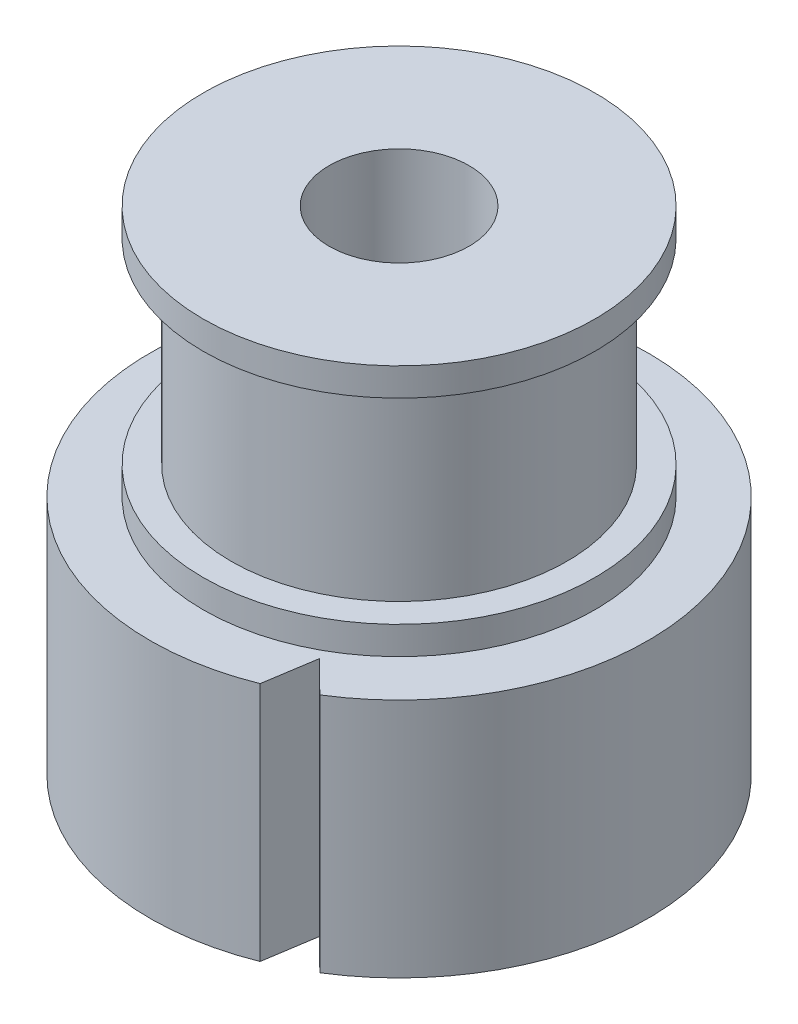
ISO-10303-21;
HEADER;
FILE_DESCRIPTION(('STEP AP214'),'2;1');
FILE_NAME('part.step','',(''),(''),'','','');
FILE_SCHEMA(('AUTOMOTIVE_DESIGN { 1 0 10303 214 1 1 1 1 }'));
ENDSEC;
DATA;
#1=APPLICATION_CONTEXT('core data for automotive mechanical design processes');
#2=APPLICATION_PROTOCOL_DEFINITION('international standard','automotive_design',2000,#1);
#3=PRODUCT_CONTEXT('',#1,'mechanical');
#4=PRODUCT('Part','Part','',(#3));
#5=PRODUCT_RELATED_PRODUCT_CATEGORY('part','',(#4));
#6=PRODUCT_DEFINITION_FORMATION('','',#4);
#7=PRODUCT_DEFINITION_CONTEXT('part definition',#1,'design');
#8=PRODUCT_DEFINITION('design','',#6,#7);
#9=PRODUCT_DEFINITION_SHAPE('','',#8);
#10=(LENGTH_UNIT() NAMED_UNIT(*) SI_UNIT(.MILLI.,.METRE.));
#11=(NAMED_UNIT(*) PLANE_ANGLE_UNIT() SI_UNIT($,.RADIAN.));
#12=(NAMED_UNIT(*) SI_UNIT($,.STERADIAN.) SOLID_ANGLE_UNIT());
#13=UNCERTAINTY_MEASURE_WITH_UNIT(LENGTH_MEASURE(1.E-05),#10,'distance_accuracy_value','');
#14=(GEOMETRIC_REPRESENTATION_CONTEXT(3) GLOBAL_UNCERTAINTY_ASSIGNED_CONTEXT((#13)) GLOBAL_UNIT_ASSIGNED_CONTEXT((#10,
#11,#12)) REPRESENTATION_CONTEXT('',''));
#15=CARTESIAN_POINT('',(0.,0.,0.));
#16=DIRECTION('',(0.,0.,1.));
#17=DIRECTION('',(1.,0.,0.));
#18=AXIS2_PLACEMENT_3D('',#15,#16,#17);
#19=CARTESIAN_POINT('',(0.,9.6,0.));
#20=DIRECTION('',(0.,1.,0.));
#21=DIRECTION('',(0.,0.,1.));
#22=AXIS2_PLACEMENT_3D('',#19,#20,#21);
#23=PLANE('',#22);
#24=CARTESIAN_POINT('',(0.,9.6,0.));
#25=DIRECTION('',(0.,1.,0.));
#26=DIRECTION('',(0.,0.,1.));
#27=AXIS2_PLACEMENT_3D('',#24,#25,#26);
#28=CIRCLE('',#27,7.);
#29=CARTESIAN_POINT('',(0.,9.6,7.));
#30=VERTEX_POINT('',#29);
#31=EDGE_CURVE('E105',#30,#30,#28,.T.);
#32=ORIENTED_EDGE('',*,*,#31,.T.);
#33=EDGE_LOOP('',(#32));
#34=FACE_BOUND('',#33,.T.);
#35=CARTESIAN_POINT('',(0.,9.6,0.));
#36=DIRECTION('',(0.,1.,0.));
#37=DIRECTION('',(0.,0.,1.));
#38=AXIS2_PLACEMENT_3D('',#35,#36,#37);
#39=CIRCLE('',#38,6.);
#40=CARTESIAN_POINT('',(0.,9.6,6.));
#41=VERTEX_POINT('',#40);
#42=EDGE_CURVE('E96',#41,#41,#39,.T.);
#43=ORIENTED_EDGE('',*,*,#42,.F.);
#44=EDGE_LOOP('',(#43));
#45=FACE_BOUND('',#44,.T.);
#46=ADVANCED_FACE('F32',(#34,#45),#23,.T.);
#47=CARTESIAN_POINT('',(0.,8.6,0.));
#48=DIRECTION('',(0.,1.,0.));
#49=DIRECTION('',(0.,0.,1.));
#50=AXIS2_PLACEMENT_3D('',#47,#48,#49);
#51=PLANE('',#50);
#52=DIRECTION('',(-0.154111230443251,0.,0.988053504953688));
#53=VECTOR('',#52,1.);
#54=CARTESIAN_POINT('',(3.29961233485813,8.6,8.26574609092561));
#55=LINE('',#54,#53);
#56=CARTESIAN_POINT('',(3.58541301827131,8.6,6.43339184813385));
#57=VERTEX_POINT('',#56);
#58=CARTESIAN_POINT('',(3.29961233485813,8.6,8.26574609092561));
#59=VERTEX_POINT('',#58);
#60=EDGE_CURVE('E66',#57,#59,#55,.T.);
#61=ORIENTED_EDGE('',*,*,#60,.F.);
#62=DIRECTION('',(-0.7119251319797,0.,-0.702255371254423));
#63=VECTOR('',#62,1.);
#64=CARTESIAN_POINT('',(3.58541301827131,8.6,6.43339184813385));
#65=LINE('',#64,#63);
#66=CARTESIAN_POINT('',(4.71549189458936,8.6,7.54812136839771));
#67=VERTEX_POINT('',#66);
#68=EDGE_CURVE('E72',#67,#57,#65,.T.);
#69=ORIENTED_EDGE('',*,*,#68,.F.);
#70=CARTESIAN_POINT('',(0.,8.6,0.));
#71=DIRECTION('',(0.,1.,0.));
#72=DIRECTION('',(0.,0.,1.));
#73=AXIS2_PLACEMENT_3D('',#70,#71,#72);
#74=CIRCLE('',#73,8.9);
#75=EDGE_CURVE('E11',#67,#59,#74,.T.);
#76=ORIENTED_EDGE('',*,*,#75,.T.);
#77=EDGE_LOOP('',(#61,#69,#76));
#78=FACE_BOUND('',#77,.T.);
#79=CARTESIAN_POINT('',(0.,8.6,0.));
#80=DIRECTION('',(0.,1.,0.));
#81=DIRECTION('',(0.,0.,1.));
#82=AXIS2_PLACEMENT_3D('',#79,#80,#81);
#83=CIRCLE('',#82,7.);
#84=CARTESIAN_POINT('',(0.,8.6,7.));
#85=VERTEX_POINT('',#84);
#86=EDGE_CURVE('E102',#85,#85,#83,.T.);
#87=ORIENTED_EDGE('',*,*,#86,.F.);
#88=EDGE_LOOP('',(#87));
#89=FACE_BOUND('',#88,.T.);
#90=ADVANCED_FACE('F80',(#78,#89),#51,.T.);
#91=CARTESIAN_POINT('',(0.,0.,0.));
#92=DIRECTION('',(0.,1.,0.));
#93=DIRECTION('',(0.,0.,1.));
#94=AXIS2_PLACEMENT_3D('',#91,#92,#93);
#95=PLANE('',#94);
#96=DIRECTION('',(-0.7119251319797,0.,-0.702255371254423));
#97=VECTOR('',#96,1.);
#98=CARTESIAN_POINT('',(3.58541301827131,0.,6.43339184813385));
#99=LINE('',#98,#97);
#100=CARTESIAN_POINT('',(4.71549189458936,0.,7.54812136839771));
#101=VERTEX_POINT('',#100);
#102=CARTESIAN_POINT('',(3.58541301827131,0.,6.43339184813385));
#103=VERTEX_POINT('',#102);
#104=EDGE_CURVE('E47',#101,#103,#99,.T.);
#105=ORIENTED_EDGE('',*,*,#104,.T.);
#106=DIRECTION('',(-0.154111230443251,0.,0.988053504953688));
#107=VECTOR('',#106,1.);
#108=CARTESIAN_POINT('',(3.29961233485813,0.,8.26574609092561));
#109=LINE('',#108,#107);
#110=CARTESIAN_POINT('',(3.29961233485813,0.,8.26574609092561));
#111=VERTEX_POINT('',#110);
#112=EDGE_CURVE('E84',#103,#111,#109,.T.);
#113=ORIENTED_EDGE('',*,*,#112,.T.);
#114=CARTESIAN_POINT('',(0.,0.,0.));
#115=DIRECTION('',(0.,1.,0.));
#116=DIRECTION('',(0.,0.,1.));
#117=AXIS2_PLACEMENT_3D('',#114,#115,#116);
#118=CIRCLE('',#117,8.9);
#119=EDGE_CURVE('E36',#101,#111,#118,.T.);
#120=ORIENTED_EDGE('',*,*,#119,.F.);
#121=EDGE_LOOP('',(#105,#113,#120));
#122=FACE_BOUND('',#121,.T.);
#123=CARTESIAN_POINT('',(0.,0.,0.));
#124=DIRECTION('',(0.,1.,0.));
#125=DIRECTION('',(0.,0.,1.));
#126=AXIS2_PLACEMENT_3D('',#123,#124,#125);
#127=CIRCLE('',#126,2.5);
#128=CARTESIAN_POINT('',(0.,0.,2.5));
#129=VERTEX_POINT('',#128);
#130=EDGE_CURVE('E108',#129,#129,#127,.T.);
#131=ORIENTED_EDGE('',*,*,#130,.T.);
#132=EDGE_LOOP('',(#131));
#133=FACE_BOUND('',#132,.T.);
#134=ADVANCED_FACE('F114',(#122,#133),#95,.F.);
#135=CARTESIAN_POINT('',(0.,8.6,0.));
#136=DIRECTION('',(0.,-1.,0.));
#137=DIRECTION('',(0.,0.,-1.));
#138=AXIS2_PLACEMENT_3D('',#135,#136,#137);
#139=CYLINDRICAL_SURFACE('',#138,8.9);
#140=ORIENTED_EDGE('',*,*,#119,.T.);
#141=DIRECTION('',(0.,1.,0.));
#142=VECTOR('',#141,1.);
#143=CARTESIAN_POINT('',(3.29961233485813,0.,8.26574609092561));
#144=LINE('',#143,#142);
#145=EDGE_CURVE('E56',#111,#59,#144,.T.);
#146=ORIENTED_EDGE('',*,*,#145,.T.);
#147=ORIENTED_EDGE('',*,*,#75,.F.);
#148=DIRECTION('',(0.,1.,0.));
#149=VECTOR('',#148,1.);
#150=CARTESIAN_POINT('',(4.71549189458936,0.,7.54812136839771));
#151=LINE('',#150,#149);
#152=EDGE_CURVE('E88',#101,#67,#151,.T.);
#153=ORIENTED_EDGE('',*,*,#152,.F.);
#154=EDGE_LOOP('',(#140,#146,#147,#153));
#155=FACE_BOUND('',#154,.T.);
#156=ADVANCED_FACE('F34',(#155),#139,.T.);
#157=CARTESIAN_POINT('',(0.,8.6,0.));
#158=DIRECTION('',(0.,-1.,0.));
#159=DIRECTION('',(0.,0.,-1.));
#160=AXIS2_PLACEMENT_3D('',#157,#158,#159);
#161=CYLINDRICAL_SURFACE('',#160,2.5);
#162=ORIENTED_EDGE('',*,*,#130,.F.);
#163=EDGE_LOOP('',(#162));
#164=FACE_BOUND('',#163,.T.);
#165=CARTESIAN_POINT('',(0.,17.6,0.));
#166=DIRECTION('',(0.,1.,0.));
#167=DIRECTION('',(0.,0.,1.));
#168=AXIS2_PLACEMENT_3D('',#165,#166,#167);
#169=CIRCLE('',#168,2.5);
#170=CARTESIAN_POINT('',(0.,17.6,2.5));
#171=VERTEX_POINT('',#170);
#172=EDGE_CURVE('E78',#171,#171,#169,.T.);
#173=ORIENTED_EDGE('',*,*,#172,.T.);
#174=EDGE_LOOP('',(#173));
#175=FACE_BOUND('',#174,.T.);
#176=ADVANCED_FACE('F116',(#164,#175),#161,.F.);
#177=CARTESIAN_POINT('',(0.,9.6,0.));
#178=DIRECTION('',(0.,-1.,0.));
#179=DIRECTION('',(0.,0.,-1.));
#180=AXIS2_PLACEMENT_3D('',#177,#178,#179);
#181=CYLINDRICAL_SURFACE('',#180,7.);
#182=ORIENTED_EDGE('',*,*,#31,.F.);
#183=EDGE_LOOP('',(#182));
#184=FACE_BOUND('',#183,.T.);
#185=ORIENTED_EDGE('',*,*,#86,.T.);
#186=EDGE_LOOP('',(#185));
#187=FACE_BOUND('',#186,.T.);
#188=ADVANCED_FACE('F119',(#184,#187),#181,.T.);
#189=CARTESIAN_POINT('',(0.,16.6,0.));
#190=DIRECTION('',(0.,-1.,0.));
#191=DIRECTION('',(0.,0.,-1.));
#192=AXIS2_PLACEMENT_3D('',#189,#190,#191);
#193=CYLINDRICAL_SURFACE('',#192,6.);
#194=CARTESIAN_POINT('',(0.,16.6,0.));
#195=DIRECTION('',(0.,1.,0.));
#196=DIRECTION('',(0.,0.,1.));
#197=AXIS2_PLACEMENT_3D('',#194,#195,#196);
#198=CIRCLE('',#197,6.);
#199=CARTESIAN_POINT('',(0.,16.6,6.));
#200=VERTEX_POINT('',#199);
#201=EDGE_CURVE('E99',#200,#200,#198,.T.);
#202=ORIENTED_EDGE('',*,*,#201,.F.);
#203=EDGE_LOOP('',(#202));
#204=FACE_BOUND('',#203,.T.);
#205=ORIENTED_EDGE('',*,*,#42,.T.);
#206=EDGE_LOOP('',(#205));
#207=FACE_BOUND('',#206,.T.);
#208=ADVANCED_FACE('F126',(#204,#207),#193,.T.);
#209=CARTESIAN_POINT('',(0.,17.6,0.));
#210=DIRECTION('',(0.,1.,0.));
#211=DIRECTION('',(0.,0.,1.));
#212=AXIS2_PLACEMENT_3D('',#209,#210,#211);
#213=PLANE('',#212);
#214=CARTESIAN_POINT('',(0.,17.6,0.));
#215=DIRECTION('',(0.,1.,0.));
#216=DIRECTION('',(0.,0.,1.));
#217=AXIS2_PLACEMENT_3D('',#214,#215,#216);
#218=CIRCLE('',#217,7.);
#219=CARTESIAN_POINT('',(0.,17.6,7.));
#220=VERTEX_POINT('',#219);
#221=EDGE_CURVE('E93',#220,#220,#218,.T.);
#222=ORIENTED_EDGE('',*,*,#221,.T.);
#223=EDGE_LOOP('',(#222));
#224=FACE_BOUND('',#223,.T.);
#225=ORIENTED_EDGE('',*,*,#172,.F.);
#226=EDGE_LOOP('',(#225));
#227=FACE_BOUND('',#226,.T.);
#228=ADVANCED_FACE('F123',(#224,#227),#213,.T.);
#229=CARTESIAN_POINT('',(0.,16.6,0.));
#230=DIRECTION('',(0.,1.,0.));
#231=DIRECTION('',(0.,0.,1.));
#232=AXIS2_PLACEMENT_3D('',#229,#230,#231);
#233=PLANE('',#232);
#234=ORIENTED_EDGE('',*,*,#201,.T.);
#235=EDGE_LOOP('',(#234));
#236=FACE_BOUND('',#235,.T.);
#237=CARTESIAN_POINT('',(0.,16.6,0.));
#238=DIRECTION('',(0.,1.,0.));
#239=DIRECTION('',(0.,0.,1.));
#240=AXIS2_PLACEMENT_3D('',#237,#238,#239);
#241=CIRCLE('',#240,7.);
#242=CARTESIAN_POINT('',(0.,16.6,7.));
#243=VERTEX_POINT('',#242);
#244=EDGE_CURVE('E92',#243,#243,#241,.T.);
#245=ORIENTED_EDGE('',*,*,#244,.F.);
#246=EDGE_LOOP('',(#245));
#247=FACE_BOUND('',#246,.T.);
#248=ADVANCED_FACE('F125',(#236,#247),#233,.F.);
#249=CARTESIAN_POINT('',(0.,17.6,0.));
#250=DIRECTION('',(0.,-1.,0.));
#251=DIRECTION('',(0.,0.,-1.));
#252=AXIS2_PLACEMENT_3D('',#249,#250,#251);
#253=CYLINDRICAL_SURFACE('',#252,7.);
#254=ORIENTED_EDGE('',*,*,#221,.F.);
#255=EDGE_LOOP('',(#254));
#256=FACE_BOUND('',#255,.T.);
#257=ORIENTED_EDGE('',*,*,#244,.T.);
#258=EDGE_LOOP('',(#257));
#259=FACE_BOUND('',#258,.T.);
#260=ADVANCED_FACE('F133',(#256,#259),#253,.T.);
#261=CARTESIAN_POINT('',(3.29961233485813,0.,8.26574609092561));
#262=DIRECTION('',(-0.988053504953688,0.,-0.154111230443251));
#263=DIRECTION('',(-0.154111230443251,0.,0.988053504953688));
#264=AXIS2_PLACEMENT_3D('',#261,#262,#263);
#265=PLANE('',#264);
#266=ORIENTED_EDGE('',*,*,#60,.T.);
#267=ORIENTED_EDGE('',*,*,#145,.F.);
#268=ORIENTED_EDGE('',*,*,#112,.F.);
#269=DIRECTION('',(0.,1.,0.));
#270=VECTOR('',#269,1.);
#271=CARTESIAN_POINT('',(3.58541301827131,0.,6.43339184813385));
#272=LINE('',#271,#270);
#273=EDGE_CURVE('E68',#103,#57,#272,.T.);
#274=ORIENTED_EDGE('',*,*,#273,.T.);
#275=EDGE_LOOP('',(#266,#267,#268,#274));
#276=FACE_BOUND('',#275,.T.);
#277=ADVANCED_FACE('F67',(#276),#265,.F.);
#278=CARTESIAN_POINT('',(3.58541301827131,0.,6.43339184813385));
#279=DIRECTION('',(0.702255371254423,0.,-0.7119251319797));
#280=DIRECTION('',(-0.7119251319797,0.,-0.702255371254423));
#281=AXIS2_PLACEMENT_3D('',#278,#279,#280);
#282=PLANE('',#281);
#283=ORIENTED_EDGE('',*,*,#68,.T.);
#284=ORIENTED_EDGE('',*,*,#273,.F.);
#285=ORIENTED_EDGE('',*,*,#104,.F.);
#286=ORIENTED_EDGE('',*,*,#152,.T.);
#287=EDGE_LOOP('',(#283,#284,#285,#286));
#288=FACE_BOUND('',#287,.T.);
#289=ADVANCED_FACE('F166',(#288),#282,.F.);
#290=CLOSED_SHELL('',(#46,#90,#134,#156,#176,#188,#208,#228,#248,#260,#277,#289));
#291=MANIFOLD_SOLID_BREP('B2',#290);
#292=ADVANCED_BREP_SHAPE_REPRESENTATION('',(#18,#291),#14);
#293=SHAPE_DEFINITION_REPRESENTATION(#9,#292);
ENDSEC;
END-ISO-10303-21;
